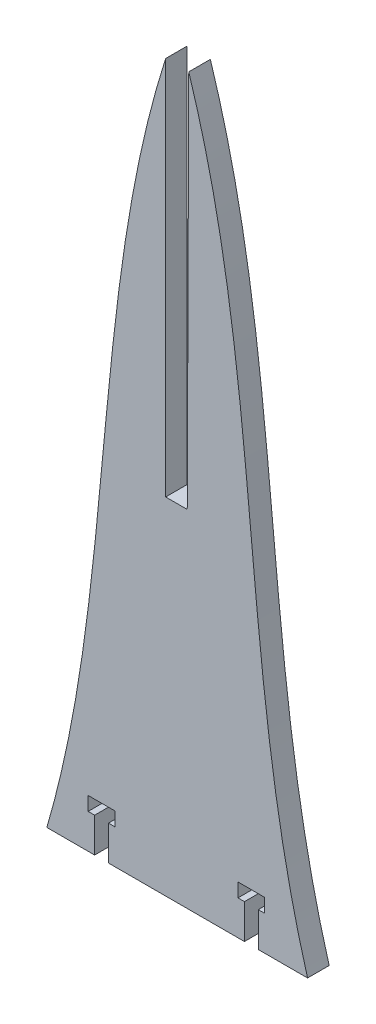
ISO-10303-21;
HEADER;
FILE_DESCRIPTION(('STEP AP214'),'2;1');
FILE_NAME('part.step','',(''),(''),'','','');
FILE_SCHEMA(('AUTOMOTIVE_DESIGN { 1 0 10303 214 1 1 1 1 }'));
ENDSEC;
DATA;
#1=APPLICATION_CONTEXT('core data for automotive mechanical design processes');
#2=APPLICATION_PROTOCOL_DEFINITION('international standard','automotive_design',2000,#1);
#3=PRODUCT_CONTEXT('',#1,'mechanical');
#4=PRODUCT('Part','Part','',(#3));
#5=PRODUCT_RELATED_PRODUCT_CATEGORY('part','',(#4));
#6=PRODUCT_DEFINITION_FORMATION('','',#4);
#7=PRODUCT_DEFINITION_CONTEXT('part definition',#1,'design');
#8=PRODUCT_DEFINITION('design','',#6,#7);
#9=PRODUCT_DEFINITION_SHAPE('','',#8);
#10=(LENGTH_UNIT() NAMED_UNIT(*) SI_UNIT(.MILLI.,.METRE.));
#11=(NAMED_UNIT(*) PLANE_ANGLE_UNIT() SI_UNIT($,.RADIAN.));
#12=(NAMED_UNIT(*) SI_UNIT($,.STERADIAN.) SOLID_ANGLE_UNIT());
#13=UNCERTAINTY_MEASURE_WITH_UNIT(LENGTH_MEASURE(1.E-05),#10,'distance_accuracy_value','');
#14=(GEOMETRIC_REPRESENTATION_CONTEXT(3) GLOBAL_UNCERTAINTY_ASSIGNED_CONTEXT((#13)) GLOBAL_UNIT_ASSIGNED_CONTEXT((#10,
#11,#12)) REPRESENTATION_CONTEXT('',''));
#15=CARTESIAN_POINT('',(0.,0.,0.));
#16=DIRECTION('',(0.,0.,1.));
#17=DIRECTION('',(1.,0.,0.));
#18=AXIS2_PLACEMENT_3D('',#15,#16,#17);
#19=CARTESIAN_POINT('',(-6.35,213.23201146882,6.35));
#20=CARTESIAN_POINT('',(-28.5059087690426,143.751265392646,6.35));
#21=CARTESIAN_POINT('',(-20.8344408737501,69.8407502357631,6.35));
#22=CARTESIAN_POINT('',(-41.275,0.,6.35));
#23=B_SPLINE_CURVE_WITH_KNOTS('',3,(#19,#20,#21,#22),.UNSPECIFIED.,.F.,.F.,(4,4),(0.,1.),.UNSPECIFIED.);
#24=DIRECTION('',(0.,0.,-1.));
#25=VECTOR('',#24,1.);
#26=SURFACE_OF_LINEAR_EXTRUSION('',#23,#25);
#27=CARTESIAN_POINT('',(-6.35,213.23201146882,0.));
#28=CARTESIAN_POINT('',(-28.5059087690426,143.751265392646,0.));
#29=CARTESIAN_POINT('',(-20.8344408737501,69.8407502357631,0.));
#30=CARTESIAN_POINT('',(-41.275,0.,0.));
#31=B_SPLINE_CURVE_WITH_KNOTS('',3,(#27,#28,#29,#30),.UNSPECIFIED.,.F.,.F.,(4,4),(0.,1.),.UNSPECIFIED.);
#32=CARTESIAN_POINT('',(-6.35,213.23201146882,0.));
#33=VERTEX_POINT('',#32);
#34=CARTESIAN_POINT('',(-41.275,0.,0.));
#35=VERTEX_POINT('',#34);
#36=EDGE_CURVE('E212',#33,#35,#31,.T.);
#37=ORIENTED_EDGE('',*,*,#36,.T.);
#38=DIRECTION('',(0.,0.,-1.));
#39=VECTOR('',#38,1.);
#40=CARTESIAN_POINT('',(-41.275,0.,6.35));
#41=LINE('',#40,#39);
#42=CARTESIAN_POINT('',(-41.275,0.,6.35));
#43=VERTEX_POINT('',#42);
#44=EDGE_CURVE('E11',#43,#35,#41,.T.);
#45=ORIENTED_EDGE('',*,*,#44,.F.);
#46=CARTESIAN_POINT('',(-6.35,213.23201146882,6.35));
#47=VERTEX_POINT('',#46);
#48=EDGE_CURVE('E264',#47,#43,#23,.T.);
#49=ORIENTED_EDGE('',*,*,#48,.F.);
#50=DIRECTION('',(0.,0.,-1.));
#51=VECTOR('',#50,1.);
#52=CARTESIAN_POINT('',(-6.35,213.23201146882,6.35));
#53=LINE('',#52,#51);
#54=EDGE_CURVE('E208',#47,#33,#53,.T.);
#55=ORIENTED_EDGE('',*,*,#54,.T.);
#56=EDGE_LOOP('',(#37,#45,#49,#55));
#57=FACE_BOUND('',#56,.T.);
#58=ADVANCED_FACE('F31',(#57),#26,.F.);
#59=CARTESIAN_POINT('',(-41.275,0.,6.35));
#60=DIRECTION('',(0.,1.,0.));
#61=DIRECTION('',(0.,0.,1.));
#62=AXIS2_PLACEMENT_3D('',#59,#60,#61);
#63=PLANE('',#62);
#64=DIRECTION('',(1.,0.,0.));
#65=VECTOR('',#64,1.);
#66=CARTESIAN_POINT('',(-41.275,0.,0.));
#67=LINE('',#66,#65);
#68=CARTESIAN_POINT('',(-27.223297828191,0.,0.));
#69=VERTEX_POINT('',#68);
#70=EDGE_CURVE('E217',#35,#69,#67,.T.);
#71=ORIENTED_EDGE('',*,*,#70,.T.);
#72=DIRECTION('',(0.,0.,-1.));
#73=VECTOR('',#72,1.);
#74=CARTESIAN_POINT('',(-27.223297828191,0.,6.35));
#75=LINE('',#74,#73);
#76=CARTESIAN_POINT('',(-27.223297828191,0.,6.35));
#77=VERTEX_POINT('',#76);
#78=EDGE_CURVE('E40',#77,#69,#75,.T.);
#79=ORIENTED_EDGE('',*,*,#78,.F.);
#80=DIRECTION('',(1.,0.,0.));
#81=VECTOR('',#80,1.);
#82=CARTESIAN_POINT('',(-41.275,0.,6.35));
#83=LINE('',#82,#81);
#84=EDGE_CURVE('E133',#43,#77,#83,.T.);
#85=ORIENTED_EDGE('',*,*,#84,.F.);
#86=ORIENTED_EDGE('',*,*,#44,.T.);
#87=EDGE_LOOP('',(#71,#79,#85,#86));
#88=FACE_BOUND('',#87,.T.);
#89=ADVANCED_FACE('F438',(#88),#63,.F.);
#90=CARTESIAN_POINT('',(-27.223297828191,0.,6.35));
#91=DIRECTION('',(-1.,0.,0.));
#92=DIRECTION('',(0.,0.,1.));
#93=AXIS2_PLACEMENT_3D('',#90,#91,#92);
#94=PLANE('',#93);
#95=DIRECTION('',(0.,1.,0.));
#96=VECTOR('',#95,1.);
#97=CARTESIAN_POINT('',(-27.223297828191,0.,0.));
#98=LINE('',#97,#96);
#99=CARTESIAN_POINT('',(-27.223297828191,10.16,0.));
#100=VERTEX_POINT('',#99);
#101=EDGE_CURVE('E222',#69,#100,#98,.T.);
#102=ORIENTED_EDGE('',*,*,#101,.T.);
#103=DIRECTION('',(0.,0.,-1.));
#104=VECTOR('',#103,1.);
#105=CARTESIAN_POINT('',(-27.223297828191,10.16,6.35));
#106=LINE('',#105,#104);
#107=CARTESIAN_POINT('',(-27.223297828191,10.16,6.35));
#108=VERTEX_POINT('',#107);
#109=EDGE_CURVE('E313',#108,#100,#106,.T.);
#110=ORIENTED_EDGE('',*,*,#109,.F.);
#111=DIRECTION('',(0.,1.,0.));
#112=VECTOR('',#111,1.);
#113=CARTESIAN_POINT('',(-27.223297828191,0.,6.35));
#114=LINE('',#113,#112);
#115=EDGE_CURVE('E321',#77,#108,#114,.T.);
#116=ORIENTED_EDGE('',*,*,#115,.F.);
#117=ORIENTED_EDGE('',*,*,#78,.T.);
#118=EDGE_LOOP('',(#102,#110,#116,#117));
#119=FACE_BOUND('',#118,.T.);
#120=ADVANCED_FACE('F319',(#119),#94,.F.);
#121=CARTESIAN_POINT('',(-27.223297828191,10.16,6.35));
#122=DIRECTION('',(0.,-1.,0.));
#123=DIRECTION('',(0.,0.,-1.));
#124=AXIS2_PLACEMENT_3D('',#121,#122,#123);
#125=PLANE('',#124);
#126=DIRECTION('',(-1.,0.,0.));
#127=VECTOR('',#126,1.);
#128=CARTESIAN_POINT('',(-27.223297828191,10.16,0.));
#129=LINE('',#128,#127);
#130=CARTESIAN_POINT('',(-29.128297828191,10.16,0.));
#131=VERTEX_POINT('',#130);
#132=EDGE_CURVE('E224',#100,#131,#129,.T.);
#133=ORIENTED_EDGE('',*,*,#132,.T.);
#134=DIRECTION('',(0.,0.,-1.));
#135=VECTOR('',#134,1.);
#136=CARTESIAN_POINT('',(-29.128297828191,10.16,6.35));
#137=LINE('',#136,#135);
#138=CARTESIAN_POINT('',(-29.128297828191,10.16,6.35));
#139=VERTEX_POINT('',#138);
#140=EDGE_CURVE('E310',#139,#131,#137,.T.);
#141=ORIENTED_EDGE('',*,*,#140,.F.);
#142=DIRECTION('',(-1.,0.,0.));
#143=VECTOR('',#142,1.);
#144=CARTESIAN_POINT('',(-27.223297828191,10.16,6.35));
#145=LINE('',#144,#143);
#146=EDGE_CURVE('E339',#108,#139,#145,.T.);
#147=ORIENTED_EDGE('',*,*,#146,.F.);
#148=ORIENTED_EDGE('',*,*,#109,.T.);
#149=EDGE_LOOP('',(#133,#141,#147,#148));
#150=FACE_BOUND('',#149,.T.);
#151=ADVANCED_FACE('F330',(#150),#125,.F.);
#152=CARTESIAN_POINT('',(-29.128297828191,10.16,6.35));
#153=DIRECTION('',(-1.,0.,0.));
#154=DIRECTION('',(0.,0.,1.));
#155=AXIS2_PLACEMENT_3D('',#152,#153,#154);
#156=PLANE('',#155);
#157=DIRECTION('',(0.,1.,0.));
#158=VECTOR('',#157,1.);
#159=CARTESIAN_POINT('',(-29.128297828191,10.16,0.));
#160=LINE('',#159,#158);
#161=CARTESIAN_POINT('',(-29.128297828191,14.224,0.));
#162=VERTEX_POINT('',#161);
#163=EDGE_CURVE('E226',#131,#162,#160,.T.);
#164=ORIENTED_EDGE('',*,*,#163,.T.);
#165=DIRECTION('',(0.,0.,-1.));
#166=VECTOR('',#165,1.);
#167=CARTESIAN_POINT('',(-29.128297828191,14.224,6.35));
#168=LINE('',#167,#166);
#169=CARTESIAN_POINT('',(-29.128297828191,14.224,6.35));
#170=VERTEX_POINT('',#169);
#171=EDGE_CURVE('E307',#170,#162,#168,.T.);
#172=ORIENTED_EDGE('',*,*,#171,.F.);
#173=DIRECTION('',(0.,1.,0.));
#174=VECTOR('',#173,1.);
#175=CARTESIAN_POINT('',(-29.128297828191,10.16,6.35));
#176=LINE('',#175,#174);
#177=EDGE_CURVE('E336',#139,#170,#176,.T.);
#178=ORIENTED_EDGE('',*,*,#177,.F.);
#179=ORIENTED_EDGE('',*,*,#140,.T.);
#180=EDGE_LOOP('',(#164,#172,#178,#179));
#181=FACE_BOUND('',#180,.T.);
#182=ADVANCED_FACE('F334',(#181),#156,.F.);
#183=CARTESIAN_POINT('',(-29.128297828191,14.224,6.35));
#184=DIRECTION('',(0.,1.,0.));
#185=DIRECTION('',(0.,0.,1.));
#186=AXIS2_PLACEMENT_3D('',#183,#184,#185);
#187=PLANE('',#186);
#188=DIRECTION('',(1.,0.,0.));
#189=VECTOR('',#188,1.);
#190=CARTESIAN_POINT('',(-29.128297828191,14.224,0.));
#191=LINE('',#190,#189);
#192=CARTESIAN_POINT('',(-21.254297828191,14.224,0.));
#193=VERTEX_POINT('',#192);
#194=EDGE_CURVE('E228',#162,#193,#191,.T.);
#195=ORIENTED_EDGE('',*,*,#194,.T.);
#196=DIRECTION('',(0.,0.,-1.));
#197=VECTOR('',#196,1.);
#198=CARTESIAN_POINT('',(-21.254297828191,14.224,6.35));
#199=LINE('',#198,#197);
#200=CARTESIAN_POINT('',(-21.254297828191,14.224,6.35));
#201=VERTEX_POINT('',#200);
#202=EDGE_CURVE('E304',#201,#193,#199,.T.);
#203=ORIENTED_EDGE('',*,*,#202,.F.);
#204=DIRECTION('',(1.,0.,0.));
#205=VECTOR('',#204,1.);
#206=CARTESIAN_POINT('',(-29.128297828191,14.224,6.35));
#207=LINE('',#206,#205);
#208=EDGE_CURVE('E338',#170,#201,#207,.T.);
#209=ORIENTED_EDGE('',*,*,#208,.F.);
#210=ORIENTED_EDGE('',*,*,#171,.T.);
#211=EDGE_LOOP('',(#195,#203,#209,#210));
#212=FACE_BOUND('',#211,.T.);
#213=ADVANCED_FACE('F428',(#212),#187,.F.);
#214=CARTESIAN_POINT('',(-21.254297828191,14.224,6.35));
#215=DIRECTION('',(1.,0.,0.));
#216=DIRECTION('',(0.,0.,-1.));
#217=AXIS2_PLACEMENT_3D('',#214,#215,#216);
#218=PLANE('',#217);
#219=DIRECTION('',(0.,-1.,0.));
#220=VECTOR('',#219,1.);
#221=CARTESIAN_POINT('',(-21.254297828191,14.224,0.));
#222=LINE('',#221,#220);
#223=CARTESIAN_POINT('',(-21.254297828191,10.16,0.));
#224=VERTEX_POINT('',#223);
#225=EDGE_CURVE('E230',#193,#224,#222,.T.);
#226=ORIENTED_EDGE('',*,*,#225,.T.);
#227=DIRECTION('',(0.,0.,-1.));
#228=VECTOR('',#227,1.);
#229=CARTESIAN_POINT('',(-21.254297828191,10.16,6.35));
#230=LINE('',#229,#228);
#231=CARTESIAN_POINT('',(-21.254297828191,10.16,6.35));
#232=VERTEX_POINT('',#231);
#233=EDGE_CURVE('E301',#232,#224,#230,.T.);
#234=ORIENTED_EDGE('',*,*,#233,.F.);
#235=DIRECTION('',(0.,-1.,0.));
#236=VECTOR('',#235,1.);
#237=CARTESIAN_POINT('',(-21.254297828191,14.224,6.35));
#238=LINE('',#237,#236);
#239=EDGE_CURVE('E341',#201,#232,#238,.T.);
#240=ORIENTED_EDGE('',*,*,#239,.F.);
#241=ORIENTED_EDGE('',*,*,#202,.T.);
#242=EDGE_LOOP('',(#226,#234,#240,#241));
#243=FACE_BOUND('',#242,.T.);
#244=ADVANCED_FACE('F424',(#243),#218,.F.);
#245=CARTESIAN_POINT('',(-21.254297828191,10.16,6.35));
#246=DIRECTION('',(0.,-1.,0.));
#247=DIRECTION('',(0.,0.,-1.));
#248=AXIS2_PLACEMENT_3D('',#245,#246,#247);
#249=PLANE('',#248);
#250=DIRECTION('',(-1.,0.,0.));
#251=VECTOR('',#250,1.);
#252=CARTESIAN_POINT('',(-21.254297828191,10.16,0.));
#253=LINE('',#252,#251);
#254=CARTESIAN_POINT('',(-23.159297828191,10.16,0.));
#255=VERTEX_POINT('',#254);
#256=EDGE_CURVE('E232',#224,#255,#253,.T.);
#257=ORIENTED_EDGE('',*,*,#256,.T.);
#258=DIRECTION('',(0.,0.,-1.));
#259=VECTOR('',#258,1.);
#260=CARTESIAN_POINT('',(-23.159297828191,10.16,6.35));
#261=LINE('',#260,#259);
#262=CARTESIAN_POINT('',(-23.159297828191,10.16,6.35));
#263=VERTEX_POINT('',#262);
#264=EDGE_CURVE('E298',#263,#255,#261,.T.);
#265=ORIENTED_EDGE('',*,*,#264,.F.);
#266=DIRECTION('',(-1.,0.,0.));
#267=VECTOR('',#266,1.);
#268=CARTESIAN_POINT('',(-21.254297828191,10.16,6.35));
#269=LINE('',#268,#267);
#270=EDGE_CURVE('E347',#232,#263,#269,.T.);
#271=ORIENTED_EDGE('',*,*,#270,.F.);
#272=ORIENTED_EDGE('',*,*,#233,.T.);
#273=EDGE_LOOP('',(#257,#265,#271,#272));
#274=FACE_BOUND('',#273,.T.);
#275=ADVANCED_FACE('F420',(#274),#249,.F.);
#276=CARTESIAN_POINT('',(-23.159297828191,10.16,6.35));
#277=DIRECTION('',(1.,0.,0.));
#278=DIRECTION('',(0.,0.,-1.));
#279=AXIS2_PLACEMENT_3D('',#276,#277,#278);
#280=PLANE('',#279);
#281=DIRECTION('',(0.,-1.,0.));
#282=VECTOR('',#281,1.);
#283=CARTESIAN_POINT('',(-23.159297828191,10.16,0.));
#284=LINE('',#283,#282);
#285=CARTESIAN_POINT('',(-23.159297828191,0.,0.));
#286=VERTEX_POINT('',#285);
#287=EDGE_CURVE('E234',#255,#286,#284,.T.);
#288=ORIENTED_EDGE('',*,*,#287,.T.);
#289=DIRECTION('',(0.,0.,-1.));
#290=VECTOR('',#289,1.);
#291=CARTESIAN_POINT('',(-23.159297828191,0.,6.35));
#292=LINE('',#291,#290);
#293=CARTESIAN_POINT('',(-23.159297828191,0.,6.35));
#294=VERTEX_POINT('',#293);
#295=EDGE_CURVE('E295',#294,#286,#292,.T.);
#296=ORIENTED_EDGE('',*,*,#295,.F.);
#297=DIRECTION('',(0.,-1.,0.));
#298=VECTOR('',#297,1.);
#299=CARTESIAN_POINT('',(-23.159297828191,10.16,6.35));
#300=LINE('',#299,#298);
#301=EDGE_CURVE('E349',#263,#294,#300,.T.);
#302=ORIENTED_EDGE('',*,*,#301,.F.);
#303=ORIENTED_EDGE('',*,*,#264,.T.);
#304=EDGE_LOOP('',(#288,#296,#302,#303));
#305=FACE_BOUND('',#304,.T.);
#306=ADVANCED_FACE('F416',(#305),#280,.F.);
#307=CARTESIAN_POINT('',(-23.159297828191,0.,6.35));
#308=DIRECTION('',(0.,1.,0.));
#309=DIRECTION('',(0.,0.,1.));
#310=AXIS2_PLACEMENT_3D('',#307,#308,#309);
#311=PLANE('',#310);
#312=DIRECTION('',(1.,0.,0.));
#313=VECTOR('',#312,1.);
#314=CARTESIAN_POINT('',(-23.159297828191,0.,0.));
#315=LINE('',#314,#313);
#316=CARTESIAN_POINT('',(16.809297828191,0.,0.));
#317=VERTEX_POINT('',#316);
#318=EDGE_CURVE('E236',#286,#317,#315,.T.);
#319=ORIENTED_EDGE('',*,*,#318,.T.);
#320=DIRECTION('',(0.,0.,-1.));
#321=VECTOR('',#320,1.);
#322=CARTESIAN_POINT('',(16.809297828191,0.,6.35));
#323=LINE('',#322,#321);
#324=CARTESIAN_POINT('',(16.809297828191,0.,6.35));
#325=VERTEX_POINT('',#324);
#326=EDGE_CURVE('E292',#325,#317,#323,.T.);
#327=ORIENTED_EDGE('',*,*,#326,.F.);
#328=DIRECTION('',(1.,0.,0.));
#329=VECTOR('',#328,1.);
#330=CARTESIAN_POINT('',(-23.159297828191,0.,6.35));
#331=LINE('',#330,#329);
#332=EDGE_CURVE('E351',#294,#325,#331,.T.);
#333=ORIENTED_EDGE('',*,*,#332,.F.);
#334=ORIENTED_EDGE('',*,*,#295,.T.);
#335=EDGE_LOOP('',(#319,#327,#333,#334));
#336=FACE_BOUND('',#335,.T.);
#337=ADVANCED_FACE('F412',(#336),#311,.F.);
#338=CARTESIAN_POINT('',(16.809297828191,10.16,6.35));
#339=DIRECTION('',(-1.,0.,0.));
#340=DIRECTION('',(0.,0.,1.));
#341=AXIS2_PLACEMENT_3D('',#338,#339,#340);
#342=PLANE('',#341);
#343=DIRECTION('',(0.,1.,0.));
#344=VECTOR('',#343,1.);
#345=CARTESIAN_POINT('',(16.809297828191,10.16,0.));
#346=LINE('',#345,#344);
#347=CARTESIAN_POINT('',(16.809297828191,10.16,0.));
#348=VERTEX_POINT('',#347);
#349=EDGE_CURVE('E238',#317,#348,#346,.T.);
#350=ORIENTED_EDGE('',*,*,#349,.T.);
#351=DIRECTION('',(0.,0.,-1.));
#352=VECTOR('',#351,1.);
#353=CARTESIAN_POINT('',(16.809297828191,10.16,6.35));
#354=LINE('',#353,#352);
#355=CARTESIAN_POINT('',(16.809297828191,10.16,6.35));
#356=VERTEX_POINT('',#355);
#357=EDGE_CURVE('E289',#356,#348,#354,.T.);
#358=ORIENTED_EDGE('',*,*,#357,.F.);
#359=DIRECTION('',(0.,1.,0.));
#360=VECTOR('',#359,1.);
#361=CARTESIAN_POINT('',(16.809297828191,10.16,6.35));
#362=LINE('',#361,#360);
#363=EDGE_CURVE('E353',#325,#356,#362,.T.);
#364=ORIENTED_EDGE('',*,*,#363,.F.);
#365=ORIENTED_EDGE('',*,*,#326,.T.);
#366=EDGE_LOOP('',(#350,#358,#364,#365));
#367=FACE_BOUND('',#366,.T.);
#368=ADVANCED_FACE('F408',(#367),#342,.F.);
#369=CARTESIAN_POINT('',(14.904297828191,10.16,6.35));
#370=DIRECTION('',(0.,-1.,0.));
#371=DIRECTION('',(0.,0.,-1.));
#372=AXIS2_PLACEMENT_3D('',#369,#370,#371);
#373=PLANE('',#372);
#374=DIRECTION('',(-1.,0.,0.));
#375=VECTOR('',#374,1.);
#376=CARTESIAN_POINT('',(14.904297828191,10.16,0.));
#377=LINE('',#376,#375);
#378=CARTESIAN_POINT('',(14.904297828191,10.16,0.));
#379=VERTEX_POINT('',#378);
#380=EDGE_CURVE('E240',#348,#379,#377,.T.);
#381=ORIENTED_EDGE('',*,*,#380,.T.);
#382=DIRECTION('',(0.,0.,-1.));
#383=VECTOR('',#382,1.);
#384=CARTESIAN_POINT('',(14.904297828191,10.16,6.35));
#385=LINE('',#384,#383);
#386=CARTESIAN_POINT('',(14.904297828191,10.16,6.35));
#387=VERTEX_POINT('',#386);
#388=EDGE_CURVE('E286',#387,#379,#385,.T.);
#389=ORIENTED_EDGE('',*,*,#388,.F.);
#390=DIRECTION('',(-1.,0.,0.));
#391=VECTOR('',#390,1.);
#392=CARTESIAN_POINT('',(14.904297828191,10.16,6.35));
#393=LINE('',#392,#391);
#394=EDGE_CURVE('E355',#356,#387,#393,.T.);
#395=ORIENTED_EDGE('',*,*,#394,.F.);
#396=ORIENTED_EDGE('',*,*,#357,.T.);
#397=EDGE_LOOP('',(#381,#389,#395,#396));
#398=FACE_BOUND('',#397,.T.);
#399=ADVANCED_FACE('F404',(#398),#373,.F.);
#400=CARTESIAN_POINT('',(14.904297828191,14.224,6.35));
#401=DIRECTION('',(-1.,0.,0.));
#402=DIRECTION('',(0.,0.,1.));
#403=AXIS2_PLACEMENT_3D('',#400,#401,#402);
#404=PLANE('',#403);
#405=DIRECTION('',(0.,1.,0.));
#406=VECTOR('',#405,1.);
#407=CARTESIAN_POINT('',(14.904297828191,14.224,0.));
#408=LINE('',#407,#406);
#409=CARTESIAN_POINT('',(14.904297828191,14.224,0.));
#410=VERTEX_POINT('',#409);
#411=EDGE_CURVE('E242',#379,#410,#408,.T.);
#412=ORIENTED_EDGE('',*,*,#411,.T.);
#413=DIRECTION('',(0.,0.,-1.));
#414=VECTOR('',#413,1.);
#415=CARTESIAN_POINT('',(14.904297828191,14.224,6.35));
#416=LINE('',#415,#414);
#417=CARTESIAN_POINT('',(14.904297828191,14.224,6.35));
#418=VERTEX_POINT('',#417);
#419=EDGE_CURVE('E283',#418,#410,#416,.T.);
#420=ORIENTED_EDGE('',*,*,#419,.F.);
#421=DIRECTION('',(0.,1.,0.));
#422=VECTOR('',#421,1.);
#423=CARTESIAN_POINT('',(14.904297828191,14.224,6.35));
#424=LINE('',#423,#422);
#425=EDGE_CURVE('E357',#387,#418,#424,.T.);
#426=ORIENTED_EDGE('',*,*,#425,.F.);
#427=ORIENTED_EDGE('',*,*,#388,.T.);
#428=EDGE_LOOP('',(#412,#420,#426,#427));
#429=FACE_BOUND('',#428,.T.);
#430=ADVANCED_FACE('F400',(#429),#404,.F.);
#431=CARTESIAN_POINT('',(22.778297828191,14.224,6.35));
#432=DIRECTION('',(0.,1.,0.));
#433=DIRECTION('',(-1.,0.,0.));
#434=AXIS2_PLACEMENT_3D('',#431,#432,#433);
#435=PLANE('',#434);
#436=DIRECTION('',(1.,0.,0.));
#437=VECTOR('',#436,1.);
#438=CARTESIAN_POINT('',(22.778297828191,14.224,0.));
#439=LINE('',#438,#437);
#440=CARTESIAN_POINT('',(22.778297828191,14.224,0.));
#441=VERTEX_POINT('',#440);
#442=EDGE_CURVE('E244',#410,#441,#439,.T.);
#443=ORIENTED_EDGE('',*,*,#442,.T.);
#444=DIRECTION('',(0.,0.,-1.));
#445=VECTOR('',#444,1.);
#446=CARTESIAN_POINT('',(22.778297828191,14.224,6.35));
#447=LINE('',#446,#445);
#448=CARTESIAN_POINT('',(22.778297828191,14.224,6.35));
#449=VERTEX_POINT('',#448);
#450=EDGE_CURVE('E280',#449,#441,#447,.T.);
#451=ORIENTED_EDGE('',*,*,#450,.F.);
#452=DIRECTION('',(1.,0.,0.));
#453=VECTOR('',#452,1.);
#454=CARTESIAN_POINT('',(22.778297828191,14.224,6.35));
#455=LINE('',#454,#453);
#456=EDGE_CURVE('E359',#418,#449,#455,.T.);
#457=ORIENTED_EDGE('',*,*,#456,.F.);
#458=ORIENTED_EDGE('',*,*,#419,.T.);
#459=EDGE_LOOP('',(#443,#451,#457,#458));
#460=FACE_BOUND('',#459,.T.);
#461=ADVANCED_FACE('F396',(#460),#435,.F.);
#462=CARTESIAN_POINT('',(22.778297828191,10.16,6.35));
#463=DIRECTION('',(1.,0.,0.));
#464=DIRECTION('',(0.,0.,-1.));
#465=AXIS2_PLACEMENT_3D('',#462,#463,#464);
#466=PLANE('',#465);
#467=DIRECTION('',(0.,-1.,0.));
#468=VECTOR('',#467,1.);
#469=CARTESIAN_POINT('',(22.778297828191,10.16,0.));
#470=LINE('',#469,#468);
#471=CARTESIAN_POINT('',(22.778297828191,10.16,0.));
#472=VERTEX_POINT('',#471);
#473=EDGE_CURVE('E246',#441,#472,#470,.T.);
#474=ORIENTED_EDGE('',*,*,#473,.T.);
#475=DIRECTION('',(0.,0.,-1.));
#476=VECTOR('',#475,1.);
#477=CARTESIAN_POINT('',(22.778297828191,10.16,6.35));
#478=LINE('',#477,#476);
#479=CARTESIAN_POINT('',(22.778297828191,10.16,6.35));
#480=VERTEX_POINT('',#479);
#481=EDGE_CURVE('E277',#480,#472,#478,.T.);
#482=ORIENTED_EDGE('',*,*,#481,.F.);
#483=DIRECTION('',(0.,-1.,0.));
#484=VECTOR('',#483,1.);
#485=CARTESIAN_POINT('',(22.778297828191,10.16,6.35));
#486=LINE('',#485,#484);
#487=EDGE_CURVE('E361',#449,#480,#486,.T.);
#488=ORIENTED_EDGE('',*,*,#487,.F.);
#489=ORIENTED_EDGE('',*,*,#450,.T.);
#490=EDGE_LOOP('',(#474,#482,#488,#489));
#491=FACE_BOUND('',#490,.T.);
#492=ADVANCED_FACE('F392',(#491),#466,.F.);
#493=CARTESIAN_POINT('',(20.873297828191,10.16,6.35));
#494=DIRECTION('',(0.,-1.,0.));
#495=DIRECTION('',(1.,0.,0.));
#496=AXIS2_PLACEMENT_3D('',#493,#494,#495);
#497=PLANE('',#496);
#498=DIRECTION('',(-1.,0.,0.));
#499=VECTOR('',#498,1.);
#500=CARTESIAN_POINT('',(20.873297828191,10.16,0.));
#501=LINE('',#500,#499);
#502=CARTESIAN_POINT('',(20.873297828191,10.16,0.));
#503=VERTEX_POINT('',#502);
#504=EDGE_CURVE('E248',#472,#503,#501,.T.);
#505=ORIENTED_EDGE('',*,*,#504,.T.);
#506=DIRECTION('',(0.,0.,-1.));
#507=VECTOR('',#506,1.);
#508=CARTESIAN_POINT('',(20.873297828191,10.16,6.35));
#509=LINE('',#508,#507);
#510=CARTESIAN_POINT('',(20.873297828191,10.16,6.35));
#511=VERTEX_POINT('',#510);
#512=EDGE_CURVE('E274',#511,#503,#509,.T.);
#513=ORIENTED_EDGE('',*,*,#512,.F.);
#514=DIRECTION('',(-1.,0.,0.));
#515=VECTOR('',#514,1.);
#516=CARTESIAN_POINT('',(20.873297828191,10.16,6.35));
#517=LINE('',#516,#515);
#518=EDGE_CURVE('E363',#480,#511,#517,.T.);
#519=ORIENTED_EDGE('',*,*,#518,.F.);
#520=ORIENTED_EDGE('',*,*,#481,.T.);
#521=EDGE_LOOP('',(#505,#513,#519,#520));
#522=FACE_BOUND('',#521,.T.);
#523=ADVANCED_FACE('F388',(#522),#497,.F.);
#524=CARTESIAN_POINT('',(20.873297828191,0.,6.35));
#525=DIRECTION('',(1.,0.,0.));
#526=DIRECTION('',(0.,0.,-1.));
#527=AXIS2_PLACEMENT_3D('',#524,#525,#526);
#528=PLANE('',#527);
#529=DIRECTION('',(0.,-1.,0.));
#530=VECTOR('',#529,1.);
#531=CARTESIAN_POINT('',(20.873297828191,0.,0.));
#532=LINE('',#531,#530);
#533=CARTESIAN_POINT('',(20.873297828191,0.,0.));
#534=VERTEX_POINT('',#533);
#535=EDGE_CURVE('E250',#503,#534,#532,.T.);
#536=ORIENTED_EDGE('',*,*,#535,.T.);
#537=DIRECTION('',(0.,0.,-1.));
#538=VECTOR('',#537,1.);
#539=CARTESIAN_POINT('',(20.873297828191,0.,6.35));
#540=LINE('',#539,#538);
#541=CARTESIAN_POINT('',(20.873297828191,0.,6.35));
#542=VERTEX_POINT('',#541);
#543=EDGE_CURVE('E271',#542,#534,#540,.T.);
#544=ORIENTED_EDGE('',*,*,#543,.F.);
#545=DIRECTION('',(0.,-1.,0.));
#546=VECTOR('',#545,1.);
#547=CARTESIAN_POINT('',(20.873297828191,0.,6.35));
#548=LINE('',#547,#546);
#549=EDGE_CURVE('E365',#511,#542,#548,.T.);
#550=ORIENTED_EDGE('',*,*,#549,.F.);
#551=ORIENTED_EDGE('',*,*,#512,.T.);
#552=EDGE_LOOP('',(#536,#544,#550,#551));
#553=FACE_BOUND('',#552,.T.);
#554=ADVANCED_FACE('F384',(#553),#528,.F.);
#555=CARTESIAN_POINT('',(20.873297828191,0.,6.35));
#556=DIRECTION('',(0.,1.,0.));
#557=DIRECTION('',(0.,0.,1.));
#558=AXIS2_PLACEMENT_3D('',#555,#556,#557);
#559=PLANE('',#558);
#560=DIRECTION('',(1.,0.,0.));
#561=VECTOR('',#560,1.);
#562=CARTESIAN_POINT('',(20.873297828191,0.,0.));
#563=LINE('',#562,#561);
#564=CARTESIAN_POINT('',(35.3698456193236,0.,0.));
#565=VERTEX_POINT('',#564);
#566=EDGE_CURVE('E252',#534,#565,#563,.T.);
#567=ORIENTED_EDGE('',*,*,#566,.T.);
#568=DIRECTION('',(0.,0.,-1.));
#569=VECTOR('',#568,1.);
#570=CARTESIAN_POINT('',(35.3698456193236,0.,6.35));
#571=LINE('',#570,#569);
#572=CARTESIAN_POINT('',(35.3698456193236,0.,6.35));
#573=VERTEX_POINT('',#572);
#574=EDGE_CURVE('E268',#573,#565,#571,.T.);
#575=ORIENTED_EDGE('',*,*,#574,.F.);
#576=DIRECTION('',(1.,0.,0.));
#577=VECTOR('',#576,1.);
#578=CARTESIAN_POINT('',(20.873297828191,0.,6.35));
#579=LINE('',#578,#577);
#580=EDGE_CURVE('E367',#542,#573,#579,.T.);
#581=ORIENTED_EDGE('',*,*,#580,.F.);
#582=ORIENTED_EDGE('',*,*,#543,.T.);
#583=EDGE_LOOP('',(#567,#575,#581,#582));
#584=FACE_BOUND('',#583,.T.);
#585=ADVANCED_FACE('F379',(#584),#559,.F.);
#586=CARTESIAN_POINT('',(35.3698456193236,0.,6.35));
#587=CARTESIAN_POINT('',(14.9292864930737,69.8407502357631,6.35));
#588=CARTESIAN_POINT('',(22.6007543883662,143.751265392646,6.35));
#589=CARTESIAN_POINT('',(0.444845619323584,213.23201146882,6.35));
#590=B_SPLINE_CURVE_WITH_KNOTS('',3,(#586,#587,#588,#589),.UNSPECIFIED.,.F.,.F.,(4,4),(0.,1.),.UNSPECIFIED.);
#591=DIRECTION('',(0.,0.,-1.));
#592=VECTOR('',#591,1.);
#593=SURFACE_OF_LINEAR_EXTRUSION('',#590,#592);
#594=CARTESIAN_POINT('',(35.3698456193236,0.,0.));
#595=CARTESIAN_POINT('',(14.9292864930737,69.8407502357631,0.));
#596=CARTESIAN_POINT('',(22.6007543883662,143.751265392646,0.));
#597=CARTESIAN_POINT('',(0.444845619323584,213.23201146882,0.));
#598=B_SPLINE_CURVE_WITH_KNOTS('',3,(#594,#595,#596,#597),.UNSPECIFIED.,.F.,.F.,(4,4),(0.,1.),.UNSPECIFIED.);
#599=CARTESIAN_POINT('',(0.444845619323584,213.23201146882,0.));
#600=VERTEX_POINT('',#599);
#601=EDGE_CURVE('E254',#565,#600,#598,.T.);
#602=ORIENTED_EDGE('',*,*,#601,.T.);
#603=DIRECTION('',(0.,0.,-1.));
#604=VECTOR('',#603,1.);
#605=CARTESIAN_POINT('',(0.444845619323584,213.23201146882,6.35));
#606=LINE('',#605,#604);
#607=CARTESIAN_POINT('',(0.444845619323584,213.23201146882,6.35));
#608=VERTEX_POINT('',#607);
#609=EDGE_CURVE('E203',#608,#600,#606,.T.);
#610=ORIENTED_EDGE('',*,*,#609,.F.);
#611=EDGE_CURVE('E194',#573,#608,#590,.T.);
#612=ORIENTED_EDGE('',*,*,#611,.F.);
#613=ORIENTED_EDGE('',*,*,#574,.T.);
#614=EDGE_LOOP('',(#602,#610,#612,#613));
#615=FACE_BOUND('',#614,.T.);
#616=ADVANCED_FACE('F375',(#615),#593,.F.);
#617=CARTESIAN_POINT('',(0.,101.6,6.35));
#618=DIRECTION('',(0.999992060265725,-0.00398489717702367,0.));
#619=DIRECTION('',(0.00398489717702367,0.999992060265725,0.));
#620=AXIS2_PLACEMENT_3D('',#617,#618,#619);
#621=PLANE('',#620);
#622=DIRECTION('',(-0.00398489717702367,-0.999992060265725,0.));
#623=VECTOR('',#622,1.);
#624=CARTESIAN_POINT('',(0.,101.6,0.));
#625=LINE('',#624,#623);
#626=CARTESIAN_POINT('',(0.,101.6,0.));
#627=VERTEX_POINT('',#626);
#628=EDGE_CURVE('E202',#600,#627,#625,.T.);
#629=ORIENTED_EDGE('',*,*,#628,.T.);
#630=DIRECTION('',(0.,0.,-1.));
#631=VECTOR('',#630,1.);
#632=CARTESIAN_POINT('',(0.,101.6,6.35));
#633=LINE('',#632,#631);
#634=CARTESIAN_POINT('',(0.,101.6,6.35));
#635=VERTEX_POINT('',#634);
#636=EDGE_CURVE('E199',#635,#627,#633,.T.);
#637=ORIENTED_EDGE('',*,*,#636,.F.);
#638=DIRECTION('',(-0.00398489717702367,-0.999992060265725,0.));
#639=VECTOR('',#638,1.);
#640=CARTESIAN_POINT('',(0.,101.6,6.35));
#641=LINE('',#640,#639);
#642=EDGE_CURVE('E188',#608,#635,#641,.T.);
#643=ORIENTED_EDGE('',*,*,#642,.F.);
#644=ORIENTED_EDGE('',*,*,#609,.T.);
#645=EDGE_LOOP('',(#629,#637,#643,#644));
#646=FACE_BOUND('',#645,.T.);
#647=ADVANCED_FACE('F200',(#646),#621,.F.);
#648=CARTESIAN_POINT('',(-6.35,101.6,6.35));
#649=DIRECTION('',(0.,-1.,0.));
#650=DIRECTION('',(0.,0.,-1.));
#651=AXIS2_PLACEMENT_3D('',#648,#649,#650);
#652=PLANE('',#651);
#653=DIRECTION('',(-1.,0.,0.));
#654=VECTOR('',#653,1.);
#655=CARTESIAN_POINT('',(-6.35,101.6,0.));
#656=LINE('',#655,#654);
#657=CARTESIAN_POINT('',(-6.35,101.6,0.));
#658=VERTEX_POINT('',#657);
#659=EDGE_CURVE('E119',#627,#658,#656,.T.);
#660=ORIENTED_EDGE('',*,*,#659,.T.);
#661=DIRECTION('',(0.,0.,-1.));
#662=VECTOR('',#661,1.);
#663=CARTESIAN_POINT('',(-6.35,101.6,6.35));
#664=LINE('',#663,#662);
#665=CARTESIAN_POINT('',(-6.35,101.6,6.35));
#666=VERTEX_POINT('',#665);
#667=EDGE_CURVE('E204',#666,#658,#664,.T.);
#668=ORIENTED_EDGE('',*,*,#667,.F.);
#669=DIRECTION('',(-1.,0.,0.));
#670=VECTOR('',#669,1.);
#671=CARTESIAN_POINT('',(-6.35,101.6,6.35));
#672=LINE('',#671,#670);
#673=EDGE_CURVE('E192',#635,#666,#672,.T.);
#674=ORIENTED_EDGE('',*,*,#673,.F.);
#675=ORIENTED_EDGE('',*,*,#636,.T.);
#676=EDGE_LOOP('',(#660,#668,#674,#675));
#677=FACE_BOUND('',#676,.T.);
#678=ADVANCED_FACE('F206',(#677),#652,.F.);
#679=CARTESIAN_POINT('',(-6.35,213.23201146882,6.35));
#680=DIRECTION('',(-1.,0.,0.));
#681=DIRECTION('',(0.,-1.,0.));
#682=AXIS2_PLACEMENT_3D('',#679,#680,#681);
#683=PLANE('',#682);
#684=DIRECTION('',(0.,1.,0.));
#685=VECTOR('',#684,1.);
#686=CARTESIAN_POINT('',(-6.35,213.23201146882,0.));
#687=LINE('',#686,#685);
#688=EDGE_CURVE('E125',#658,#33,#687,.T.);
#689=ORIENTED_EDGE('',*,*,#688,.T.);
#690=ORIENTED_EDGE('',*,*,#54,.F.);
#691=DIRECTION('',(0.,1.,0.));
#692=VECTOR('',#691,1.);
#693=CARTESIAN_POINT('',(-6.35,213.23201146882,6.35));
#694=LINE('',#693,#692);
#695=EDGE_CURVE('E48',#666,#47,#694,.T.);
#696=ORIENTED_EDGE('',*,*,#695,.F.);
#697=ORIENTED_EDGE('',*,*,#667,.T.);
#698=EDGE_LOOP('',(#689,#690,#696,#697));
#699=FACE_BOUND('',#698,.T.);
#700=ADVANCED_FACE('F484',(#699),#683,.F.);
#701=CARTESIAN_POINT('',(-24.4557561160473,106.751007294256,6.35));
#702=DIRECTION('',(0.,0.,-1.));
#703=DIRECTION('',(-1.,0.,0.));
#704=AXIS2_PLACEMENT_3D('',#701,#702,#703);
#705=PLANE('',#704);
#706=ORIENTED_EDGE('',*,*,#48,.T.);
#707=ORIENTED_EDGE('',*,*,#84,.T.);
#708=ORIENTED_EDGE('',*,*,#115,.T.);
#709=ORIENTED_EDGE('',*,*,#146,.T.);
#710=ORIENTED_EDGE('',*,*,#177,.T.);
#711=ORIENTED_EDGE('',*,*,#208,.T.);
#712=ORIENTED_EDGE('',*,*,#239,.T.);
#713=ORIENTED_EDGE('',*,*,#270,.T.);
#714=ORIENTED_EDGE('',*,*,#301,.T.);
#715=ORIENTED_EDGE('',*,*,#332,.T.);
#716=ORIENTED_EDGE('',*,*,#363,.T.);
#717=ORIENTED_EDGE('',*,*,#394,.T.);
#718=ORIENTED_EDGE('',*,*,#425,.T.);
#719=ORIENTED_EDGE('',*,*,#456,.T.);
#720=ORIENTED_EDGE('',*,*,#487,.T.);
#721=ORIENTED_EDGE('',*,*,#518,.T.);
#722=ORIENTED_EDGE('',*,*,#549,.T.);
#723=ORIENTED_EDGE('',*,*,#580,.T.);
#724=ORIENTED_EDGE('',*,*,#611,.T.);
#725=ORIENTED_EDGE('',*,*,#642,.T.);
#726=ORIENTED_EDGE('',*,*,#673,.T.);
#727=ORIENTED_EDGE('',*,*,#695,.T.);
#728=EDGE_LOOP('',(#706,#707,#708,#709,#710,#711,#712,#713,#714,#715,#716,#717,#718,#719,#720,
#721,#722,#723,#724,#725,#726,#727));
#729=FACE_BOUND('',#728,.T.);
#730=ADVANCED_FACE('F190',(#729),#705,.F.);
#731=CARTESIAN_POINT('',(-24.4557561160473,106.751007294256,0.));
#732=DIRECTION('',(0.,0.,-1.));
#733=DIRECTION('',(-1.,0.,0.));
#734=AXIS2_PLACEMENT_3D('',#731,#732,#733);
#735=PLANE('',#734);
#736=ORIENTED_EDGE('',*,*,#36,.F.);
#737=ORIENTED_EDGE('',*,*,#688,.F.);
#738=ORIENTED_EDGE('',*,*,#659,.F.);
#739=ORIENTED_EDGE('',*,*,#628,.F.);
#740=ORIENTED_EDGE('',*,*,#601,.F.);
#741=ORIENTED_EDGE('',*,*,#566,.F.);
#742=ORIENTED_EDGE('',*,*,#535,.F.);
#743=ORIENTED_EDGE('',*,*,#504,.F.);
#744=ORIENTED_EDGE('',*,*,#473,.F.);
#745=ORIENTED_EDGE('',*,*,#442,.F.);
#746=ORIENTED_EDGE('',*,*,#411,.F.);
#747=ORIENTED_EDGE('',*,*,#380,.F.);
#748=ORIENTED_EDGE('',*,*,#349,.F.);
#749=ORIENTED_EDGE('',*,*,#318,.F.);
#750=ORIENTED_EDGE('',*,*,#287,.F.);
#751=ORIENTED_EDGE('',*,*,#256,.F.);
#752=ORIENTED_EDGE('',*,*,#225,.F.);
#753=ORIENTED_EDGE('',*,*,#194,.F.);
#754=ORIENTED_EDGE('',*,*,#163,.F.);
#755=ORIENTED_EDGE('',*,*,#132,.F.);
#756=ORIENTED_EDGE('',*,*,#101,.F.);
#757=ORIENTED_EDGE('',*,*,#70,.F.);
#758=EDGE_LOOP('',(#736,#737,#738,#739,#740,#741,#742,#743,#744,#745,#746,#747,#748,#749,#750,
#751,#752,#753,#754,#755,#756,#757));
#759=FACE_BOUND('',#758,.T.);
#760=ADVANCED_FACE('F325',(#759),#735,.T.);
#761=CLOSED_SHELL('',(#58,#89,#120,#151,#182,#213,#244,#275,#306,#337,#368,#399,#430,#461,#492,
#523,#554,#585,#616,#647,#678,#700,#730,#760));
#762=MANIFOLD_SOLID_BREP('B2',#761);
#763=ADVANCED_BREP_SHAPE_REPRESENTATION('',(#18,#762),#14);
#764=SHAPE_DEFINITION_REPRESENTATION(#9,#763);
ENDSEC;
END-ISO-10303-21;
